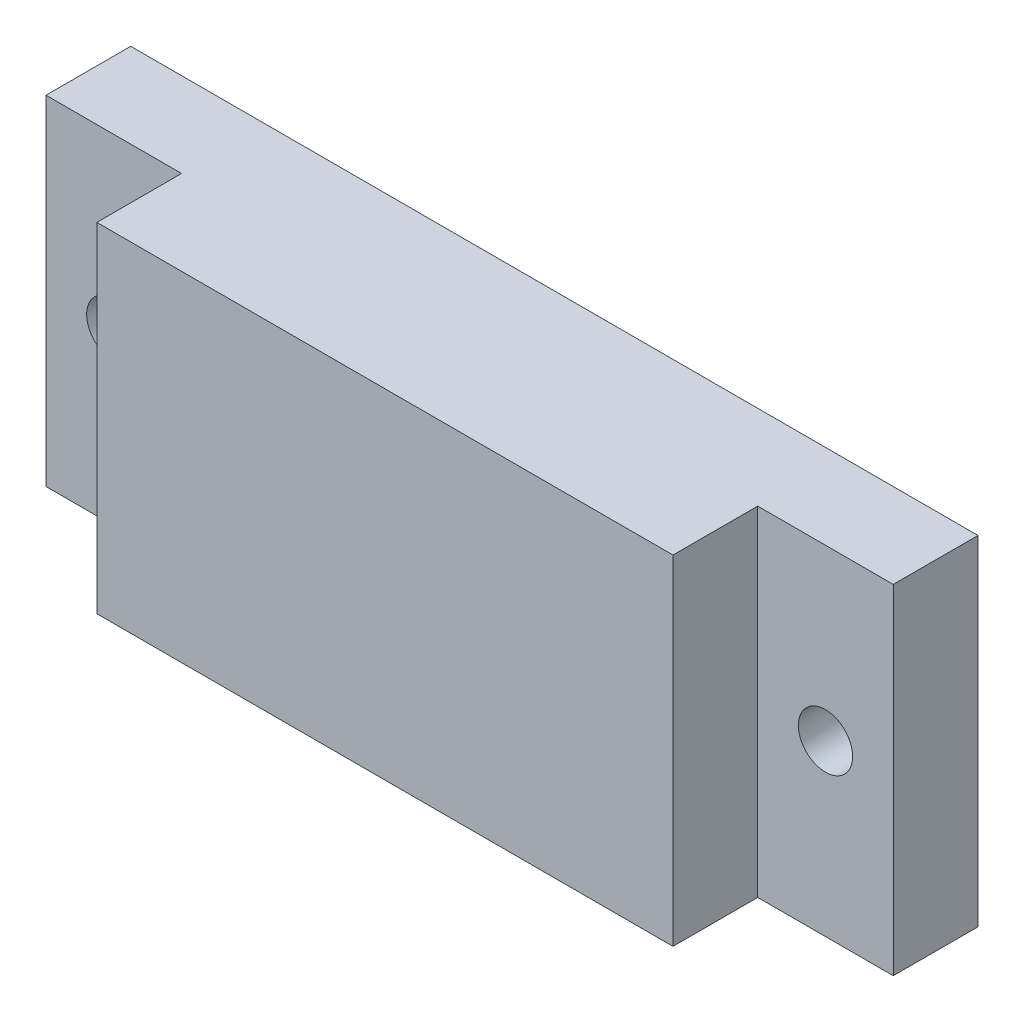
ISO-10303-21;
HEADER;
FILE_DESCRIPTION(('STEP AP214'),'2;1');
FILE_NAME('part.step','',(''),(''),'','','');
FILE_SCHEMA(('AUTOMOTIVE_DESIGN { 1 0 10303 214 1 1 1 1 }'));
ENDSEC;
DATA;
#1=APPLICATION_CONTEXT('core data for automotive mechanical design processes');
#2=APPLICATION_PROTOCOL_DEFINITION('international standard','automotive_design',2000,#1);
#3=PRODUCT_CONTEXT('',#1,'mechanical');
#4=PRODUCT('Part','Part','',(#3));
#5=PRODUCT_RELATED_PRODUCT_CATEGORY('part','',(#4));
#6=PRODUCT_DEFINITION_FORMATION('','',#4);
#7=PRODUCT_DEFINITION_CONTEXT('part definition',#1,'design');
#8=PRODUCT_DEFINITION('design','',#6,#7);
#9=PRODUCT_DEFINITION_SHAPE('','',#8);
#10=(LENGTH_UNIT() NAMED_UNIT(*) SI_UNIT(.MILLI.,.METRE.));
#11=(NAMED_UNIT(*) PLANE_ANGLE_UNIT() SI_UNIT($,.RADIAN.));
#12=(NAMED_UNIT(*) SI_UNIT($,.STERADIAN.) SOLID_ANGLE_UNIT());
#13=UNCERTAINTY_MEASURE_WITH_UNIT(LENGTH_MEASURE(1.E-05),#10,'distance_accuracy_value','');
#14=(GEOMETRIC_REPRESENTATION_CONTEXT(3) GLOBAL_UNCERTAINTY_ASSIGNED_CONTEXT((#13)) GLOBAL_UNIT_ASSIGNED_CONTEXT((#10,
#11,#12)) REPRESENTATION_CONTEXT('',''));
#15=CARTESIAN_POINT('',(0.,0.,0.));
#16=DIRECTION('',(0.,0.,1.));
#17=DIRECTION('',(1.,0.,0.));
#18=AXIS2_PLACEMENT_3D('',#15,#16,#17);
#19=CARTESIAN_POINT('',(0.,0.,5.));
#20=DIRECTION('',(0.,0.,1.));
#21=DIRECTION('',(1.,0.,0.));
#22=AXIS2_PLACEMENT_3D('',#19,#20,#21);
#23=PLANE('',#22);
#24=CARTESIAN_POINT('',(-5.26573426573427,15.3496503496503,5.));
#25=DIRECTION('',(0.,0.,1.));
#26=DIRECTION('',(1.,0.,0.));
#27=AXIS2_PLACEMENT_3D('',#24,#25,#26);
#28=CIRCLE('',#27,1.6);
#29=CARTESIAN_POINT('',(-3.66573426573427,15.3496503496503,5.));
#30=VERTEX_POINT('',#29);
#31=EDGE_CURVE('E183',#30,#30,#28,.T.);
#32=ORIENTED_EDGE('',*,*,#31,.F.);
#33=EDGE_LOOP('',(#32));
#34=FACE_BOUND('',#33,.T.);
#35=DIRECTION('',(0.,-1.,0.));
#36=VECTOR('',#35,1.);
#37=CARTESIAN_POINT('',(-1.26573426573427,25.3496503496503,5.));
#38=LINE('',#37,#36);
#39=CARTESIAN_POINT('',(-1.26573426573427,25.3496503496503,5.));
#40=VERTEX_POINT('',#39);
#41=CARTESIAN_POINT('',(-1.26573426573427,5.34965034965034,5.));
#42=VERTEX_POINT('',#41);
#43=EDGE_CURVE('E49',#40,#42,#38,.T.);
#44=ORIENTED_EDGE('',*,*,#43,.F.);
#45=DIRECTION('',(-1.,0.,0.));
#46=VECTOR('',#45,1.);
#47=CARTESIAN_POINT('',(-9.26573426573427,25.3496503496503,5.));
#48=LINE('',#47,#46);
#49=CARTESIAN_POINT('',(-9.26573426573427,25.3496503496503,5.));
#50=VERTEX_POINT('',#49);
#51=EDGE_CURVE('E138',#40,#50,#48,.T.);
#52=ORIENTED_EDGE('',*,*,#51,.T.);
#53=DIRECTION('',(0.,-1.,0.));
#54=VECTOR('',#53,1.);
#55=CARTESIAN_POINT('',(-9.26573426573427,25.3496503496503,5.));
#56=LINE('',#55,#54);
#57=CARTESIAN_POINT('',(-9.26573426573427,5.34965034965034,5.));
#58=VERTEX_POINT('',#57);
#59=EDGE_CURVE('E129',#50,#58,#56,.T.);
#60=ORIENTED_EDGE('',*,*,#59,.T.);
#61=DIRECTION('',(1.,0.,0.));
#62=VECTOR('',#61,1.);
#63=CARTESIAN_POINT('',(-9.26573426573427,5.34965034965034,5.));
#64=LINE('',#63,#62);
#65=EDGE_CURVE('E134',#58,#42,#64,.T.);
#66=ORIENTED_EDGE('',*,*,#65,.T.);
#67=EDGE_LOOP('',(#44,#52,#60,#66));
#68=FACE_BOUND('',#67,.T.);
#69=ADVANCED_FACE('F34',(#34,#68),#23,.T.);
#70=CARTESIAN_POINT('',(-9.26573426573427,25.3496503496503,5.));
#71=DIRECTION('',(1.,0.,0.));
#72=DIRECTION('',(0.,0.,-1.));
#73=AXIS2_PLACEMENT_3D('',#70,#71,#72);
#74=PLANE('',#73);
#75=DIRECTION('',(0.,-1.,0.));
#76=VECTOR('',#75,1.);
#77=CARTESIAN_POINT('',(-9.26573426573427,25.3496503496503,0.));
#78=LINE('',#77,#76);
#79=CARTESIAN_POINT('',(-9.26573426573427,25.3496503496503,0.));
#80=VERTEX_POINT('',#79);
#81=CARTESIAN_POINT('',(-9.26573426573427,5.34965034965034,0.));
#82=VERTEX_POINT('',#81);
#83=EDGE_CURVE('E120',#80,#82,#78,.T.);
#84=ORIENTED_EDGE('',*,*,#83,.T.);
#85=DIRECTION('',(0.,0.,-1.));
#86=VECTOR('',#85,1.);
#87=CARTESIAN_POINT('',(-9.26573426573427,5.34965034965034,5.));
#88=LINE('',#87,#86);
#89=EDGE_CURVE('E11',#58,#82,#88,.T.);
#90=ORIENTED_EDGE('',*,*,#89,.F.);
#91=ORIENTED_EDGE('',*,*,#59,.F.);
#92=DIRECTION('',(0.,0.,-1.));
#93=VECTOR('',#92,1.);
#94=CARTESIAN_POINT('',(-9.26573426573427,25.3496503496503,5.));
#95=LINE('',#94,#93);
#96=EDGE_CURVE('E140',#50,#80,#95,.T.);
#97=ORIENTED_EDGE('',*,*,#96,.T.);
#98=EDGE_LOOP('',(#84,#90,#91,#97));
#99=FACE_BOUND('',#98,.T.);
#100=ADVANCED_FACE('F36',(#99),#74,.F.);
#101=CARTESIAN_POINT('',(-9.26573426573427,5.34965034965034,5.));
#102=DIRECTION('',(0.,1.,0.));
#103=DIRECTION('',(0.,0.,1.));
#104=AXIS2_PLACEMENT_3D('',#101,#102,#103);
#105=PLANE('',#104);
#106=DIRECTION('',(1.,0.,0.));
#107=VECTOR('',#106,1.);
#108=CARTESIAN_POINT('',(-9.26573426573427,5.34965034965034,0.));
#109=LINE('',#108,#107);
#110=CARTESIAN_POINT('',(40.7342657342657,5.34965034965034,0.));
#111=VERTEX_POINT('',#110);
#112=EDGE_CURVE('E123',#82,#111,#109,.T.);
#113=ORIENTED_EDGE('',*,*,#112,.T.);
#114=DIRECTION('',(0.,0.,-1.));
#115=VECTOR('',#114,1.);
#116=CARTESIAN_POINT('',(40.7342657342657,5.34965034965034,5.));
#117=LINE('',#116,#115);
#118=CARTESIAN_POINT('',(40.7342657342657,5.34965034965034,5.));
#119=VERTEX_POINT('',#118);
#120=EDGE_CURVE('E42',#119,#111,#117,.T.);
#121=ORIENTED_EDGE('',*,*,#120,.F.);
#122=CARTESIAN_POINT('',(32.7342657342657,5.34965034965034,5.));
#123=VERTEX_POINT('',#122);
#124=EDGE_CURVE('E132',#123,#119,#64,.T.);
#125=ORIENTED_EDGE('',*,*,#124,.F.);
#126=DIRECTION('',(0.,0.,-1.));
#127=VECTOR('',#126,1.);
#128=CARTESIAN_POINT('',(32.7342657342657,5.34965034965034,10.));
#129=LINE('',#128,#127);
#130=CARTESIAN_POINT('',(32.7342657342657,5.34965034965034,10.));
#131=VERTEX_POINT('',#130);
#132=EDGE_CURVE('E105',#131,#123,#129,.T.);
#133=ORIENTED_EDGE('',*,*,#132,.F.);
#134=DIRECTION('',(1.,0.,0.));
#135=VECTOR('',#134,1.);
#136=CARTESIAN_POINT('',(-1.26573426573427,5.34965034965034,10.));
#137=LINE('',#136,#135);
#138=CARTESIAN_POINT('',(-1.26573426573427,5.34965034965034,10.));
#139=VERTEX_POINT('',#138);
#140=EDGE_CURVE('E99',#139,#131,#137,.T.);
#141=ORIENTED_EDGE('',*,*,#140,.F.);
#142=DIRECTION('',(0.,0.,-1.));
#143=VECTOR('',#142,1.);
#144=CARTESIAN_POINT('',(-1.26573426573427,5.34965034965034,10.));
#145=LINE('',#144,#143);
#146=EDGE_CURVE('E103',#139,#42,#145,.T.);
#147=ORIENTED_EDGE('',*,*,#146,.T.);
#148=ORIENTED_EDGE('',*,*,#65,.F.);
#149=ORIENTED_EDGE('',*,*,#89,.T.);
#150=EDGE_LOOP('',(#113,#121,#125,#133,#141,#147,#148,#149));
#151=FACE_BOUND('',#150,.T.);
#152=ADVANCED_FACE('F101',(#151),#105,.F.);
#153=CARTESIAN_POINT('',(40.7342657342657,25.3496503496503,5.));
#154=DIRECTION('',(-1.,0.,0.));
#155=DIRECTION('',(0.,-1.,0.));
#156=AXIS2_PLACEMENT_3D('',#153,#154,#155);
#157=PLANE('',#156);
#158=DIRECTION('',(0.,1.,0.));
#159=VECTOR('',#158,1.);
#160=CARTESIAN_POINT('',(40.7342657342657,25.3496503496503,0.));
#161=LINE('',#160,#159);
#162=CARTESIAN_POINT('',(40.7342657342657,25.3496503496503,0.));
#163=VERTEX_POINT('',#162);
#164=EDGE_CURVE('E143',#111,#163,#161,.T.);
#165=ORIENTED_EDGE('',*,*,#164,.T.);
#166=DIRECTION('',(0.,0.,-1.));
#167=VECTOR('',#166,1.);
#168=CARTESIAN_POINT('',(40.7342657342657,25.3496503496503,5.));
#169=LINE('',#168,#167);
#170=CARTESIAN_POINT('',(40.7342657342657,25.3496503496503,5.));
#171=VERTEX_POINT('',#170);
#172=EDGE_CURVE('E148',#171,#163,#169,.T.);
#173=ORIENTED_EDGE('',*,*,#172,.F.);
#174=DIRECTION('',(0.,1.,0.));
#175=VECTOR('',#174,1.);
#176=CARTESIAN_POINT('',(40.7342657342657,25.3496503496503,5.));
#177=LINE('',#176,#175);
#178=EDGE_CURVE('E136',#119,#171,#177,.T.);
#179=ORIENTED_EDGE('',*,*,#178,.F.);
#180=ORIENTED_EDGE('',*,*,#120,.T.);
#181=EDGE_LOOP('',(#165,#173,#179,#180));
#182=FACE_BOUND('',#181,.T.);
#183=ADVANCED_FACE('F155',(#182),#157,.F.);
#184=CARTESIAN_POINT('',(-9.26573426573427,25.3496503496503,5.));
#185=DIRECTION('',(0.,-1.,0.));
#186=DIRECTION('',(0.,0.,-1.));
#187=AXIS2_PLACEMENT_3D('',#184,#185,#186);
#188=PLANE('',#187);
#189=DIRECTION('',(-1.,0.,0.));
#190=VECTOR('',#189,1.);
#191=CARTESIAN_POINT('',(-9.26573426573427,25.3496503496503,0.));
#192=LINE('',#191,#190);
#193=EDGE_CURVE('E133',#163,#80,#192,.T.);
#194=ORIENTED_EDGE('',*,*,#193,.T.);
#195=ORIENTED_EDGE('',*,*,#96,.F.);
#196=ORIENTED_EDGE('',*,*,#51,.F.);
#197=DIRECTION('',(0.,0.,-1.));
#198=VECTOR('',#197,1.);
#199=CARTESIAN_POINT('',(-1.26573426573427,25.3496503496503,10.));
#200=LINE('',#199,#198);
#201=CARTESIAN_POINT('',(-1.26573426573427,25.3496503496503,10.));
#202=VERTEX_POINT('',#201);
#203=EDGE_CURVE('E168',#202,#40,#200,.T.);
#204=ORIENTED_EDGE('',*,*,#203,.F.);
#205=DIRECTION('',(-1.,0.,0.));
#206=VECTOR('',#205,1.);
#207=CARTESIAN_POINT('',(-1.26573426573427,25.3496503496503,10.));
#208=LINE('',#207,#206);
#209=CARTESIAN_POINT('',(32.7342657342657,25.3496503496503,10.));
#210=VERTEX_POINT('',#209);
#211=EDGE_CURVE('E114',#210,#202,#208,.T.);
#212=ORIENTED_EDGE('',*,*,#211,.F.);
#213=DIRECTION('',(0.,0.,-1.));
#214=VECTOR('',#213,1.);
#215=CARTESIAN_POINT('',(32.7342657342657,25.3496503496503,10.));
#216=LINE('',#215,#214);
#217=CARTESIAN_POINT('',(32.7342657342657,25.3496503496503,5.));
#218=VERTEX_POINT('',#217);
#219=EDGE_CURVE('E125',#210,#218,#216,.T.);
#220=ORIENTED_EDGE('',*,*,#219,.T.);
#221=EDGE_CURVE('E139',#171,#218,#48,.T.);
#222=ORIENTED_EDGE('',*,*,#221,.F.);
#223=ORIENTED_EDGE('',*,*,#172,.T.);
#224=EDGE_LOOP('',(#194,#195,#196,#204,#212,#220,#222,#223));
#225=FACE_BOUND('',#224,.T.);
#226=ADVANCED_FACE('F163',(#225),#188,.F.);
#227=CARTESIAN_POINT('',(36.7342657342657,15.3496503496503,5.));
#228=DIRECTION('',(0.,0.,1.));
#229=DIRECTION('',(-1.,0.,0.));
#230=AXIS2_PLACEMENT_3D('',#227,#228,#229);
#231=CIRCLE('',#230,1.59999999999999);
#232=CARTESIAN_POINT('',(35.1342657342657,15.3496503496503,5.));
#233=VERTEX_POINT('',#232);
#234=EDGE_CURVE('E177',#233,#233,#231,.T.);
#235=ORIENTED_EDGE('',*,*,#234,.F.);
#236=EDGE_LOOP('',(#235));
#237=FACE_BOUND('',#236,.T.);
#238=DIRECTION('',(0.,1.,0.));
#239=VECTOR('',#238,1.);
#240=CARTESIAN_POINT('',(32.7342657342657,5.34965034965034,5.));
#241=LINE('',#240,#239);
#242=EDGE_CURVE('E57',#123,#218,#241,.T.);
#243=ORIENTED_EDGE('',*,*,#242,.F.);
#244=ORIENTED_EDGE('',*,*,#124,.T.);
#245=ORIENTED_EDGE('',*,*,#178,.T.);
#246=ORIENTED_EDGE('',*,*,#221,.T.);
#247=EDGE_LOOP('',(#243,#244,#245,#246));
#248=FACE_BOUND('',#247,.T.);
#249=ADVANCED_FACE('F200',(#237,#248),#23,.T.);
#250=CARTESIAN_POINT('',(0.,0.,0.));
#251=DIRECTION('',(0.,0.,1.));
#252=DIRECTION('',(1.,0.,0.));
#253=AXIS2_PLACEMENT_3D('',#250,#251,#252);
#254=PLANE('',#253);
#255=CARTESIAN_POINT('',(-5.26573426573427,15.3496503496503,0.));
#256=DIRECTION('',(0.,0.,1.));
#257=DIRECTION('',(1.,0.,0.));
#258=AXIS2_PLACEMENT_3D('',#255,#256,#257);
#259=CIRCLE('',#258,1.6);
#260=CARTESIAN_POINT('',(-3.66573426573427,15.3496503496503,0.));
#261=VERTEX_POINT('',#260);
#262=EDGE_CURVE('E174',#261,#261,#259,.T.);
#263=ORIENTED_EDGE('',*,*,#262,.T.);
#264=EDGE_LOOP('',(#263));
#265=FACE_BOUND('',#264,.T.);
#266=CARTESIAN_POINT('',(36.7342657342657,15.3496503496503,0.));
#267=DIRECTION('',(0.,0.,1.));
#268=DIRECTION('',(-1.,0.,0.));
#269=AXIS2_PLACEMENT_3D('',#266,#267,#268);
#270=CIRCLE('',#269,1.59999999999999);
#271=CARTESIAN_POINT('',(35.1342657342657,15.3496503496503,0.));
#272=VERTEX_POINT('',#271);
#273=EDGE_CURVE('E180',#272,#272,#270,.T.);
#274=ORIENTED_EDGE('',*,*,#273,.T.);
#275=EDGE_LOOP('',(#274));
#276=FACE_BOUND('',#275,.T.);
#277=ORIENTED_EDGE('',*,*,#83,.F.);
#278=ORIENTED_EDGE('',*,*,#193,.F.);
#279=ORIENTED_EDGE('',*,*,#164,.F.);
#280=ORIENTED_EDGE('',*,*,#112,.F.);
#281=EDGE_LOOP('',(#277,#278,#279,#280));
#282=FACE_BOUND('',#281,.T.);
#283=ADVANCED_FACE('F160',(#265,#276,#282),#254,.F.);
#284=CARTESIAN_POINT('',(-1.26573426573427,25.3496503496503,10.));
#285=DIRECTION('',(1.,0.,0.));
#286=DIRECTION('',(0.,0.,-1.));
#287=AXIS2_PLACEMENT_3D('',#284,#285,#286);
#288=PLANE('',#287);
#289=ORIENTED_EDGE('',*,*,#43,.T.);
#290=ORIENTED_EDGE('',*,*,#146,.F.);
#291=DIRECTION('',(0.,-1.,0.));
#292=VECTOR('',#291,1.);
#293=CARTESIAN_POINT('',(-1.26573426573427,25.3496503496503,10.));
#294=LINE('',#293,#292);
#295=EDGE_CURVE('E109',#202,#139,#294,.T.);
#296=ORIENTED_EDGE('',*,*,#295,.F.);
#297=ORIENTED_EDGE('',*,*,#203,.T.);
#298=EDGE_LOOP('',(#289,#290,#296,#297));
#299=FACE_BOUND('',#298,.T.);
#300=ADVANCED_FACE('F119',(#299),#288,.F.);
#301=CARTESIAN_POINT('',(32.7342657342657,5.34965034965034,10.));
#302=DIRECTION('',(-1.,0.,0.));
#303=DIRECTION('',(0.,0.,1.));
#304=AXIS2_PLACEMENT_3D('',#301,#302,#303);
#305=PLANE('',#304);
#306=ORIENTED_EDGE('',*,*,#242,.T.);
#307=ORIENTED_EDGE('',*,*,#219,.F.);
#308=DIRECTION('',(0.,1.,0.));
#309=VECTOR('',#308,1.);
#310=CARTESIAN_POINT('',(32.7342657342657,5.34965034965034,10.));
#311=LINE('',#310,#309);
#312=EDGE_CURVE('E108',#131,#210,#311,.T.);
#313=ORIENTED_EDGE('',*,*,#312,.F.);
#314=ORIENTED_EDGE('',*,*,#132,.T.);
#315=EDGE_LOOP('',(#306,#307,#313,#314));
#316=FACE_BOUND('',#315,.T.);
#317=ADVANCED_FACE('F221',(#316),#305,.F.);
#318=CARTESIAN_POINT('',(0.,0.,10.));
#319=DIRECTION('',(0.,0.,1.));
#320=DIRECTION('',(1.,0.,0.));
#321=AXIS2_PLACEMENT_3D('',#318,#319,#320);
#322=PLANE('',#321);
#323=ORIENTED_EDGE('',*,*,#295,.T.);
#324=ORIENTED_EDGE('',*,*,#140,.T.);
#325=ORIENTED_EDGE('',*,*,#312,.T.);
#326=ORIENTED_EDGE('',*,*,#211,.T.);
#327=EDGE_LOOP('',(#323,#324,#325,#326));
#328=FACE_BOUND('',#327,.T.);
#329=ADVANCED_FACE('F112',(#328),#322,.T.);
#330=CARTESIAN_POINT('',(36.7342657342657,15.3496503496503,0.));
#331=DIRECTION('',(0.,0.,1.));
#332=DIRECTION('',(1.,0.,0.));
#333=AXIS2_PLACEMENT_3D('',#330,#331,#332);
#334=CYLINDRICAL_SURFACE('',#333,1.59999999999999);
#335=ORIENTED_EDGE('',*,*,#273,.F.);
#336=EDGE_LOOP('',(#335));
#337=FACE_BOUND('',#336,.T.);
#338=ORIENTED_EDGE('',*,*,#234,.T.);
#339=EDGE_LOOP('',(#338));
#340=FACE_BOUND('',#339,.T.);
#341=ADVANCED_FACE('F194',(#337,#340),#334,.F.);
#342=CARTESIAN_POINT('',(-5.26573426573427,15.3496503496503,0.));
#343=DIRECTION('',(0.,0.,1.));
#344=DIRECTION('',(1.,0.,0.));
#345=AXIS2_PLACEMENT_3D('',#342,#343,#344);
#346=CYLINDRICAL_SURFACE('',#345,1.6);
#347=ORIENTED_EDGE('',*,*,#262,.F.);
#348=EDGE_LOOP('',(#347));
#349=FACE_BOUND('',#348,.T.);
#350=ORIENTED_EDGE('',*,*,#31,.T.);
#351=EDGE_LOOP('',(#350));
#352=FACE_BOUND('',#351,.T.);
#353=ADVANCED_FACE('F191',(#349,#352),#346,.F.);
#354=CLOSED_SHELL('',(#69,#100,#152,#183,#226,#249,#283,#300,#317,#329,#341,#353));
#355=MANIFOLD_SOLID_BREP('B2',#354);
#356=ADVANCED_BREP_SHAPE_REPRESENTATION('',(#18,#355),#14);
#357=SHAPE_DEFINITION_REPRESENTATION(#9,#356);
ENDSEC;
END-ISO-10303-21;
